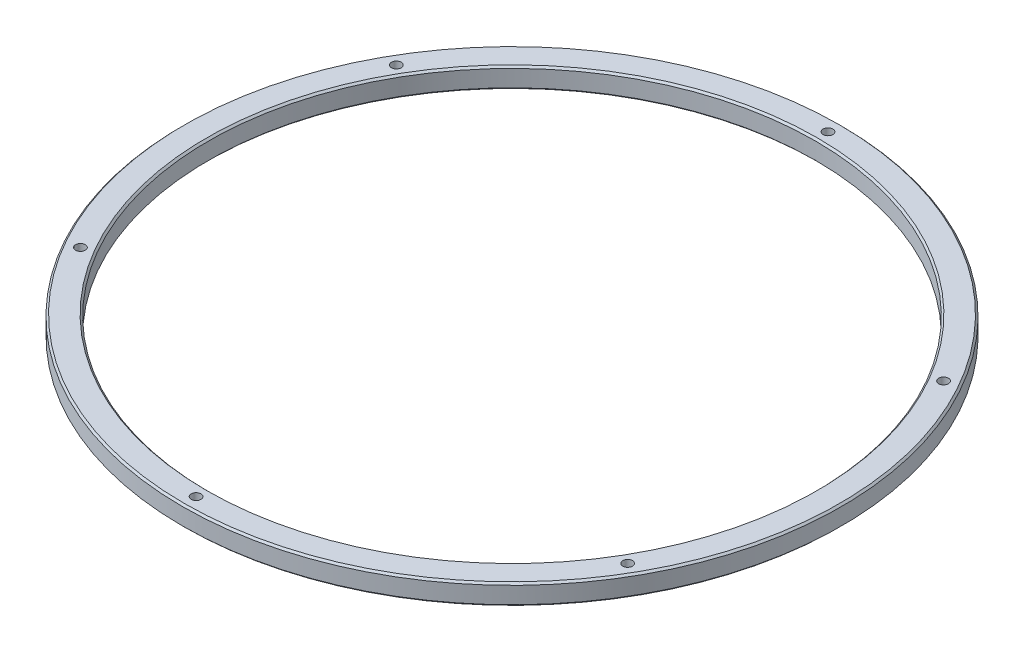
ISO-10303-21;
HEADER;
FILE_DESCRIPTION(('STEP AP214'),'2;1');
FILE_NAME('part.step','',(''),(''),'','','');
FILE_SCHEMA(('AUTOMOTIVE_DESIGN { 1 0 10303 214 1 1 1 1 }'));
ENDSEC;
DATA;
#1=APPLICATION_CONTEXT('core data for automotive mechanical design processes');
#2=APPLICATION_PROTOCOL_DEFINITION('international standard','automotive_design',2000,#1);
#3=PRODUCT_CONTEXT('',#1,'mechanical');
#4=PRODUCT('Part','Part','',(#3));
#5=PRODUCT_RELATED_PRODUCT_CATEGORY('part','',(#4));
#6=PRODUCT_DEFINITION_FORMATION('','',#4);
#7=PRODUCT_DEFINITION_CONTEXT('part definition',#1,'design');
#8=PRODUCT_DEFINITION('design','',#6,#7);
#9=PRODUCT_DEFINITION_SHAPE('','',#8);
#10=(LENGTH_UNIT() NAMED_UNIT(*) SI_UNIT(.MILLI.,.METRE.));
#11=(NAMED_UNIT(*) PLANE_ANGLE_UNIT() SI_UNIT($,.RADIAN.));
#12=(NAMED_UNIT(*) SI_UNIT($,.STERADIAN.) SOLID_ANGLE_UNIT());
#13=UNCERTAINTY_MEASURE_WITH_UNIT(LENGTH_MEASURE(1.E-05),#10,'distance_accuracy_value','');
#14=(GEOMETRIC_REPRESENTATION_CONTEXT(3) GLOBAL_UNCERTAINTY_ASSIGNED_CONTEXT((#13)) GLOBAL_UNIT_ASSIGNED_CONTEXT((#10,
#11,#12)) REPRESENTATION_CONTEXT('',''));
#15=CARTESIAN_POINT('',(0.,0.,0.));
#16=DIRECTION('',(0.,0.,1.));
#17=DIRECTION('',(1.,0.,0.));
#18=AXIS2_PLACEMENT_3D('',#15,#16,#17);
#19=CARTESIAN_POINT('',(0.,10.,0.));
#20=DIRECTION('',(0.,1.,0.));
#21=DIRECTION('',(0.,0.,1.));
#22=AXIS2_PLACEMENT_3D('',#19,#20,#21);
#23=PLANE('',#22);
#24=CARTESIAN_POINT('',(0.,10.,0.));
#25=DIRECTION('',(0.,1.,0.));
#26=DIRECTION('',(0.,0.,1.));
#27=AXIS2_PLACEMENT_3D('',#24,#25,#26);
#28=CIRCLE('',#27,149.346000012);
#29=CARTESIAN_POINT('',(0.,10.,149.346000012));
#30=VERTEX_POINT('',#29);
#31=EDGE_CURVE('E83',#30,#30,#28,.F.);
#32=ORIENTED_EDGE('',*,*,#31,.T.);
#33=EDGE_LOOP('',(#32));
#34=FACE_BOUND('',#33,.T.);
#35=CARTESIAN_POINT('',(0.,10.,0.));
#36=DIRECTION('',(0.,1.,0.));
#37=DIRECTION('',(0.,0.,1.));
#38=AXIS2_PLACEMENT_3D('',#35,#36,#37);
#39=CIRCLE('',#38,160.268000012);
#40=CARTESIAN_POINT('',(0.,10.,160.268000012));
#41=VERTEX_POINT('',#40);
#42=EDGE_CURVE('E87',#41,#41,#39,.T.);
#43=ORIENTED_EDGE('',*,*,#42,.T.);
#44=EDGE_LOOP('',(#43));
#45=FACE_BOUND('',#44,.T.);
#46=CARTESIAN_POINT('',(-133.80092488471,10.,77.2499999999761));
#47=DIRECTION('',(0.,1.,0.));
#48=DIRECTION('',(0.,0.,1.));
#49=AXIS2_PLACEMENT_3D('',#46,#47,#48);
#50=CIRCLE('',#49,2.38125);
#51=CARTESIAN_POINT('',(-133.80092488471,10.,79.6312499999761));
#52=VERTEX_POINT('',#51);
#53=EDGE_CURVE('E128',#52,#52,#50,.T.);
#54=ORIENTED_EDGE('',*,*,#53,.F.);
#55=EDGE_LOOP('',(#54));
#56=FACE_BOUND('',#55,.T.);
#57=CARTESIAN_POINT('',(133.800924884689,10.,77.2500000000119));
#58=DIRECTION('',(0.,1.,0.));
#59=DIRECTION('',(0.,0.,1.));
#60=AXIS2_PLACEMENT_3D('',#57,#58,#59);
#61=CIRCLE('',#60,2.38125);
#62=CARTESIAN_POINT('',(133.800924884689,10.,79.6312500000119));
#63=VERTEX_POINT('',#62);
#64=EDGE_CURVE('E116',#63,#63,#61,.T.);
#65=ORIENTED_EDGE('',*,*,#64,.F.);
#66=EDGE_LOOP('',(#65));
#67=FACE_BOUND('',#66,.T.);
#68=CARTESIAN_POINT('',(0.,10.,-154.5));
#69=DIRECTION('',(0.,1.,0.));
#70=DIRECTION('',(0.,0.,1.));
#71=AXIS2_PLACEMENT_3D('',#68,#69,#70);
#72=CIRCLE('',#71,2.38125);
#73=CARTESIAN_POINT('',(0.,10.,-152.11875));
#74=VERTEX_POINT('',#73);
#75=EDGE_CURVE('E107',#74,#74,#72,.T.);
#76=ORIENTED_EDGE('',*,*,#75,.F.);
#77=EDGE_LOOP('',(#76));
#78=FACE_BOUND('',#77,.T.);
#79=CARTESIAN_POINT('',(133.800924884699,10.,-77.249999999994));
#80=DIRECTION('',(0.,1.,0.));
#81=DIRECTION('',(0.,0.,1.));
#82=AXIS2_PLACEMENT_3D('',#79,#80,#81);
#83=CIRCLE('',#82,2.38125);
#84=CARTESIAN_POINT('',(133.800924884699,10.,-74.868749999994));
#85=VERTEX_POINT('',#84);
#86=EDGE_CURVE('E111',#85,#85,#83,.T.);
#87=ORIENTED_EDGE('',*,*,#86,.F.);
#88=EDGE_LOOP('',(#87));
#89=FACE_BOUND('',#88,.T.);
#90=CARTESIAN_POINT('',(-2.06332258664254E-11,10.,154.5));
#91=DIRECTION('',(0.,1.,0.));
#92=DIRECTION('',(0.,0.,1.));
#93=AXIS2_PLACEMENT_3D('',#90,#91,#92);
#94=CIRCLE('',#93,2.38125);
#95=CARTESIAN_POINT('',(-2.06332258664254E-11,10.,156.88125));
#96=VERTEX_POINT('',#95);
#97=EDGE_CURVE('E123',#96,#96,#94,.T.);
#98=ORIENTED_EDGE('',*,*,#97,.F.);
#99=EDGE_LOOP('',(#98));
#100=FACE_BOUND('',#99,.T.);
#101=CARTESIAN_POINT('',(-133.800924884678,10.,-77.25000000003));
#102=DIRECTION('',(0.,1.,0.));
#103=DIRECTION('',(0.,0.,1.));
#104=AXIS2_PLACEMENT_3D('',#101,#102,#103);
#105=CIRCLE('',#104,2.38125);
#106=CARTESIAN_POINT('',(-133.800924884678,10.,-74.86875000003));
#107=VERTEX_POINT('',#106);
#108=EDGE_CURVE('E135',#107,#107,#105,.T.);
#109=ORIENTED_EDGE('',*,*,#108,.F.);
#110=EDGE_LOOP('',(#109));
#111=FACE_BOUND('',#110,.T.);
#112=ADVANCED_FACE('F42',(#34,#45,#56,#67,#78,#89,#100,#111),#23,.T.);
#113=CARTESIAN_POINT('',(0.,0.,0.));
#114=DIRECTION('',(0.,1.,0.));
#115=DIRECTION('',(0.,0.,1.));
#116=AXIS2_PLACEMENT_3D('',#113,#114,#115);
#117=PLANE('',#116);
#118=CARTESIAN_POINT('',(133.800924884689,0.,77.2500000000119));
#119=DIRECTION('',(0.,1.,0.));
#120=DIRECTION('',(0.,0.,1.));
#121=AXIS2_PLACEMENT_3D('',#118,#119,#120);
#122=CIRCLE('',#121,4.92124999999999);
#123=CARTESIAN_POINT('',(133.800924884689,0.,82.1712500000119));
#124=VERTEX_POINT('',#123);
#125=EDGE_CURVE('E61',#124,#124,#122,.T.);
#126=ORIENTED_EDGE('',*,*,#125,.T.);
#127=EDGE_LOOP('',(#126));
#128=FACE_BOUND('',#127,.T.);
#129=CARTESIAN_POINT('',(-133.80092488471,0.,77.2499999999761));
#130=DIRECTION('',(0.,1.,0.));
#131=DIRECTION('',(0.,0.,1.));
#132=AXIS2_PLACEMENT_3D('',#129,#130,#131);
#133=CIRCLE('',#132,4.51256306319026);
#134=CARTESIAN_POINT('',(-133.80092488471,0.,81.7625630631663));
#135=VERTEX_POINT('',#134);
#136=EDGE_CURVE('E67',#135,#135,#133,.T.);
#137=ORIENTED_EDGE('',*,*,#136,.T.);
#138=EDGE_LOOP('',(#137));
#139=FACE_BOUND('',#138,.T.);
#140=CARTESIAN_POINT('',(0.,0.,-154.5));
#141=DIRECTION('',(0.,1.,0.));
#142=DIRECTION('',(0.,0.,1.));
#143=AXIS2_PLACEMENT_3D('',#140,#141,#142);
#144=CIRCLE('',#143,4.51256306319026);
#145=CARTESIAN_POINT('',(0.,0.,-149.98743693681));
#146=VERTEX_POINT('',#145);
#147=EDGE_CURVE('E71',#146,#146,#144,.T.);
#148=ORIENTED_EDGE('',*,*,#147,.T.);
#149=EDGE_LOOP('',(#148));
#150=FACE_BOUND('',#149,.T.);
#151=CARTESIAN_POINT('',(0.,0.,0.));
#152=DIRECTION('',(0.,1.,0.));
#153=DIRECTION('',(0.,0.,1.));
#154=AXIS2_PLACEMENT_3D('',#151,#152,#153);
#155=CIRCLE('',#154,149.346000012);
#156=CARTESIAN_POINT('',(0.,0.,149.346000012));
#157=VERTEX_POINT('',#156);
#158=EDGE_CURVE('E99',#157,#157,#155,.T.);
#159=ORIENTED_EDGE('',*,*,#158,.T.);
#160=EDGE_LOOP('',(#159));
#161=FACE_BOUND('',#160,.T.);
#162=CARTESIAN_POINT('',(0.,0.,0.));
#163=DIRECTION('',(0.,1.,0.));
#164=DIRECTION('',(0.,0.,1.));
#165=AXIS2_PLACEMENT_3D('',#162,#163,#164);
#166=CIRCLE('',#165,160.268000012);
#167=CARTESIAN_POINT('',(0.,0.,160.268000012));
#168=VERTEX_POINT('',#167);
#169=EDGE_CURVE('E103',#168,#168,#166,.F.);
#170=ORIENTED_EDGE('',*,*,#169,.T.);
#171=EDGE_LOOP('',(#170));
#172=FACE_BOUND('',#171,.T.);
#173=CARTESIAN_POINT('',(133.800924884699,0.,-77.249999999994));
#174=DIRECTION('',(0.,1.,0.));
#175=DIRECTION('',(0.,0.,1.));
#176=AXIS2_PLACEMENT_3D('',#173,#174,#175);
#177=CIRCLE('',#176,2.38125);
#178=CARTESIAN_POINT('',(133.800924884699,0.,-74.868749999994));
#179=VERTEX_POINT('',#178);
#180=EDGE_CURVE('E112',#179,#179,#177,.T.);
#181=ORIENTED_EDGE('',*,*,#180,.T.);
#182=EDGE_LOOP('',(#181));
#183=FACE_BOUND('',#182,.T.);
#184=CARTESIAN_POINT('',(-2.06332258664254E-11,0.,154.5));
#185=DIRECTION('',(0.,1.,0.));
#186=DIRECTION('',(0.,0.,1.));
#187=AXIS2_PLACEMENT_3D('',#184,#185,#186);
#188=CIRCLE('',#187,2.38125);
#189=CARTESIAN_POINT('',(-2.06332258664254E-11,0.,156.88125));
#190=VERTEX_POINT('',#189);
#191=EDGE_CURVE('E124',#190,#190,#188,.T.);
#192=ORIENTED_EDGE('',*,*,#191,.T.);
#193=EDGE_LOOP('',(#192));
#194=FACE_BOUND('',#193,.T.);
#195=CARTESIAN_POINT('',(-133.800924884678,0.,-77.25000000003));
#196=DIRECTION('',(0.,1.,0.));
#197=DIRECTION('',(0.,0.,1.));
#198=AXIS2_PLACEMENT_3D('',#195,#196,#197);
#199=CIRCLE('',#198,2.38125);
#200=CARTESIAN_POINT('',(-133.800924884678,0.,-74.86875000003));
#201=VERTEX_POINT('',#200);
#202=EDGE_CURVE('E136',#201,#201,#199,.T.);
#203=ORIENTED_EDGE('',*,*,#202,.T.);
#204=EDGE_LOOP('',(#203));
#205=FACE_BOUND('',#204,.T.);
#206=ADVANCED_FACE('F148',(#128,#139,#150,#161,#172,#183,#194,#205),#117,.F.);
#207=CARTESIAN_POINT('',(0.,10.,0.));
#208=DIRECTION('',(0.,-1.,0.));
#209=DIRECTION('',(0.,0.,-1.));
#210=AXIS2_PLACEMENT_3D('',#207,#208,#209);
#211=CYLINDRICAL_SURFACE('',#210,161.157000012);
#212=CARTESIAN_POINT('',(0.,0.889000000000112,0.));
#213=DIRECTION('',(0.,1.,0.));
#214=DIRECTION('',(0.,0.,1.));
#215=AXIS2_PLACEMENT_3D('',#212,#213,#214);
#216=CIRCLE('',#215,161.157000012);
#217=CARTESIAN_POINT('',(0.,0.889000000000112,161.157000012));
#218=VERTEX_POINT('',#217);
#219=EDGE_CURVE('E75',#218,#218,#216,.T.);
#220=ORIENTED_EDGE('',*,*,#219,.T.);
#221=EDGE_LOOP('',(#220));
#222=FACE_BOUND('',#221,.T.);
#223=CARTESIAN_POINT('',(0.,9.11100000000008,0.));
#224=DIRECTION('',(0.,1.,0.));
#225=DIRECTION('',(0.,0.,1.));
#226=AXIS2_PLACEMENT_3D('',#223,#224,#225);
#227=CIRCLE('',#226,161.157000012);
#228=CARTESIAN_POINT('',(0.,9.11100000000008,161.157000012));
#229=VERTEX_POINT('',#228);
#230=EDGE_CURVE('E79',#229,#229,#227,.F.);
#231=ORIENTED_EDGE('',*,*,#230,.T.);
#232=EDGE_LOOP('',(#231));
#233=FACE_BOUND('',#232,.T.);
#234=ADVANCED_FACE('F154',(#222,#233),#211,.T.);
#235=CARTESIAN_POINT('',(0.,10.,0.));
#236=DIRECTION('',(0.,-1.,0.));
#237=DIRECTION('',(0.,0.,-1.));
#238=AXIS2_PLACEMENT_3D('',#235,#236,#237);
#239=CYLINDRICAL_SURFACE('',#238,148.457000012);
#240=CARTESIAN_POINT('',(0.,0.888999999999945,0.));
#241=DIRECTION('',(0.,1.,0.));
#242=DIRECTION('',(0.,0.,1.));
#243=AXIS2_PLACEMENT_3D('',#240,#241,#242);
#244=CIRCLE('',#243,148.457000012);
#245=CARTESIAN_POINT('',(0.,0.888999999999945,148.457000012));
#246=VERTEX_POINT('',#245);
#247=EDGE_CURVE('E91',#246,#246,#244,.F.);
#248=ORIENTED_EDGE('',*,*,#247,.T.);
#249=EDGE_LOOP('',(#248));
#250=FACE_BOUND('',#249,.T.);
#251=CARTESIAN_POINT('',(0.,9.11100000000008,0.));
#252=DIRECTION('',(0.,1.,0.));
#253=DIRECTION('',(0.,0.,1.));
#254=AXIS2_PLACEMENT_3D('',#251,#252,#253);
#255=CIRCLE('',#254,148.457000012);
#256=CARTESIAN_POINT('',(0.,9.11100000000008,148.457000012));
#257=VERTEX_POINT('',#256);
#258=EDGE_CURVE('E95',#257,#257,#255,.T.);
#259=ORIENTED_EDGE('',*,*,#258,.T.);
#260=EDGE_LOOP('',(#259));
#261=FACE_BOUND('',#260,.T.);
#262=ADVANCED_FACE('F159',(#250,#261),#239,.F.);
#263=CARTESIAN_POINT('',(0.,10.,-154.5));
#264=DIRECTION('',(0.,-1.,0.));
#265=DIRECTION('',(0.,0.,-1.));
#266=AXIS2_PLACEMENT_3D('',#263,#264,#265);
#267=CYLINDRICAL_SURFACE('',#266,2.38125);
#268=CARTESIAN_POINT('',(0.,2.53999999999994,-154.5));
#269=DIRECTION('',(0.,1.,0.));
#270=DIRECTION('',(0.,0.,1.));
#271=AXIS2_PLACEMENT_3D('',#268,#269,#270);
#272=CIRCLE('',#271,2.38125);
#273=CARTESIAN_POINT('',(0.,2.53999999999994,-152.11875));
#274=VERTEX_POINT('',#273);
#275=EDGE_CURVE('E10',#274,#274,#272,.F.);
#276=ORIENTED_EDGE('',*,*,#275,.T.);
#277=EDGE_LOOP('',(#276));
#278=FACE_BOUND('',#277,.T.);
#279=ORIENTED_EDGE('',*,*,#75,.T.);
#280=EDGE_LOOP('',(#279));
#281=FACE_BOUND('',#280,.T.);
#282=ADVANCED_FACE('F242',(#278,#281),#267,.F.);
#283=CARTESIAN_POINT('',(133.800924884699,10.,-77.249999999994));
#284=DIRECTION('',(0.,-1.,0.));
#285=DIRECTION('',(0.,0.,-1.));
#286=AXIS2_PLACEMENT_3D('',#283,#284,#285);
#287=CYLINDRICAL_SURFACE('',#286,2.38125);
#288=ORIENTED_EDGE('',*,*,#86,.T.);
#289=EDGE_LOOP('',(#288));
#290=FACE_BOUND('',#289,.T.);
#291=ORIENTED_EDGE('',*,*,#180,.F.);
#292=EDGE_LOOP('',(#291));
#293=FACE_BOUND('',#292,.T.);
#294=ADVANCED_FACE('F239',(#290,#293),#287,.F.);
#295=CARTESIAN_POINT('',(133.800924884689,10.,77.2500000000119));
#296=DIRECTION('',(0.,-1.,0.));
#297=DIRECTION('',(0.,0.,-1.));
#298=AXIS2_PLACEMENT_3D('',#295,#296,#297);
#299=CYLINDRICAL_SURFACE('',#298,2.38125);
#300=CARTESIAN_POINT('',(133.800924884689,2.13131306319025,77.2500000000119));
#301=DIRECTION('',(0.,1.,0.));
#302=DIRECTION('',(0.,0.,1.));
#303=AXIS2_PLACEMENT_3D('',#300,#301,#302);
#304=CIRCLE('',#303,2.38125);
#305=CARTESIAN_POINT('',(133.800924884689,2.13131306319025,79.6312500000119));
#306=VERTEX_POINT('',#305);
#307=EDGE_CURVE('E56',#306,#306,#304,.F.);
#308=ORIENTED_EDGE('',*,*,#307,.T.);
#309=EDGE_LOOP('',(#308));
#310=FACE_BOUND('',#309,.T.);
#311=ORIENTED_EDGE('',*,*,#64,.T.);
#312=EDGE_LOOP('',(#311));
#313=FACE_BOUND('',#312,.T.);
#314=ADVANCED_FACE('F235',(#310,#313),#299,.F.);
#315=CARTESIAN_POINT('',(-2.06332258664254E-11,10.,154.5));
#316=DIRECTION('',(0.,-1.,0.));
#317=DIRECTION('',(0.,0.,-1.));
#318=AXIS2_PLACEMENT_3D('',#315,#316,#317);
#319=CYLINDRICAL_SURFACE('',#318,2.38125);
#320=ORIENTED_EDGE('',*,*,#97,.T.);
#321=EDGE_LOOP('',(#320));
#322=FACE_BOUND('',#321,.T.);
#323=ORIENTED_EDGE('',*,*,#191,.F.);
#324=EDGE_LOOP('',(#323));
#325=FACE_BOUND('',#324,.T.);
#326=ADVANCED_FACE('F230',(#322,#325),#319,.F.);
#327=CARTESIAN_POINT('',(-133.80092488471,10.,77.2499999999761));
#328=DIRECTION('',(0.,-1.,0.));
#329=DIRECTION('',(0.,0.,-1.));
#330=AXIS2_PLACEMENT_3D('',#327,#328,#329);
#331=CYLINDRICAL_SURFACE('',#330,2.38125);
#332=CARTESIAN_POINT('',(-133.80092488471,2.54000000000001,77.2499999999761));
#333=DIRECTION('',(0.,1.,0.));
#334=DIRECTION('',(0.,0.,1.));
#335=AXIS2_PLACEMENT_3D('',#332,#333,#334);
#336=CIRCLE('',#335,2.38125);
#337=CARTESIAN_POINT('',(-133.80092488471,2.54000000000001,79.6312499999761));
#338=VERTEX_POINT('',#337);
#339=EDGE_CURVE('E51',#338,#338,#336,.F.);
#340=ORIENTED_EDGE('',*,*,#339,.T.);
#341=EDGE_LOOP('',(#340));
#342=FACE_BOUND('',#341,.T.);
#343=ORIENTED_EDGE('',*,*,#53,.T.);
#344=EDGE_LOOP('',(#343));
#345=FACE_BOUND('',#344,.T.);
#346=ADVANCED_FACE('F225',(#342,#345),#331,.F.);
#347=CARTESIAN_POINT('',(-133.800924884678,10.,-77.25000000003));
#348=DIRECTION('',(0.,-1.,0.));
#349=DIRECTION('',(0.,0.,-1.));
#350=AXIS2_PLACEMENT_3D('',#347,#348,#349);
#351=CYLINDRICAL_SURFACE('',#350,2.38125);
#352=ORIENTED_EDGE('',*,*,#108,.T.);
#353=EDGE_LOOP('',(#352));
#354=FACE_BOUND('',#353,.T.);
#355=ORIENTED_EDGE('',*,*,#202,.F.);
#356=EDGE_LOOP('',(#355));
#357=FACE_BOUND('',#356,.T.);
#358=ADVANCED_FACE('F144',(#354,#357),#351,.F.);
#359=CARTESIAN_POINT('',(0.,0.,0.));
#360=DIRECTION('',(0.,-1.,0.));
#361=DIRECTION('',(0.,0.,-1.));
#362=AXIS2_PLACEMENT_3D('',#359,#360,#361);
#363=CONICAL_SURFACE('',#362,149.346000012,0.785398163397433);
#364=ORIENTED_EDGE('',*,*,#247,.F.);
#365=EDGE_LOOP('',(#364));
#366=FACE_BOUND('',#365,.T.);
#367=ORIENTED_EDGE('',*,*,#158,.F.);
#368=EDGE_LOOP('',(#367));
#369=FACE_BOUND('',#368,.T.);
#370=ADVANCED_FACE('F166',(#366,#369),#363,.F.);
#371=CARTESIAN_POINT('',(0.,9.11100000000008,0.));
#372=DIRECTION('',(0.,1.,0.));
#373=DIRECTION('',(0.,0.,1.));
#374=AXIS2_PLACEMENT_3D('',#371,#372,#373);
#375=CONICAL_SURFACE('',#374,148.457000012,0.78539816339748);
#376=ORIENTED_EDGE('',*,*,#31,.F.);
#377=EDGE_LOOP('',(#376));
#378=FACE_BOUND('',#377,.T.);
#379=ORIENTED_EDGE('',*,*,#258,.F.);
#380=EDGE_LOOP('',(#379));
#381=FACE_BOUND('',#380,.T.);
#382=ADVANCED_FACE('F172',(#378,#381),#375,.F.);
#383=CARTESIAN_POINT('',(0.,0.889000000000112,0.));
#384=DIRECTION('',(0.,1.,0.));
#385=DIRECTION('',(0.,0.,1.));
#386=AXIS2_PLACEMENT_3D('',#383,#384,#385);
#387=CONICAL_SURFACE('',#386,161.157000012,0.785398163397448);
#388=ORIENTED_EDGE('',*,*,#169,.F.);
#389=EDGE_LOOP('',(#388));
#390=FACE_BOUND('',#389,.T.);
#391=ORIENTED_EDGE('',*,*,#219,.F.);
#392=EDGE_LOOP('',(#391));
#393=FACE_BOUND('',#392,.T.);
#394=ADVANCED_FACE('F179',(#390,#393),#387,.T.);
#395=CARTESIAN_POINT('',(0.,10.,0.));
#396=DIRECTION('',(0.,-1.,0.));
#397=DIRECTION('',(0.,0.,-1.));
#398=AXIS2_PLACEMENT_3D('',#395,#396,#397);
#399=CONICAL_SURFACE('',#398,160.268000012,0.785398163397448);
#400=ORIENTED_EDGE('',*,*,#230,.F.);
#401=EDGE_LOOP('',(#400));
#402=FACE_BOUND('',#401,.T.);
#403=ORIENTED_EDGE('',*,*,#42,.F.);
#404=EDGE_LOOP('',(#403));
#405=FACE_BOUND('',#404,.T.);
#406=ADVANCED_FACE('F186',(#402,#405),#399,.T.);
#407=CARTESIAN_POINT('',(133.800924884689,0.,77.2500000000119));
#408=DIRECTION('',(0.,-1.,0.));
#409=DIRECTION('',(0.,0.,-1.));
#410=AXIS2_PLACEMENT_3D('',#407,#408,#409);
#411=CONICAL_SURFACE('',#410,4.92124999999999,0.872664625997172);
#412=ORIENTED_EDGE('',*,*,#307,.F.);
#413=EDGE_LOOP('',(#412));
#414=FACE_BOUND('',#413,.T.);
#415=ORIENTED_EDGE('',*,*,#125,.F.);
#416=EDGE_LOOP('',(#415));
#417=FACE_BOUND('',#416,.T.);
#418=ADVANCED_FACE('F193',(#414,#417),#411,.F.);
#419=CARTESIAN_POINT('',(-133.80092488471,0.,77.2499999999761));
#420=DIRECTION('',(0.,-1.,0.));
#421=DIRECTION('',(0.,0.,-1.));
#422=AXIS2_PLACEMENT_3D('',#419,#420,#421);
#423=CONICAL_SURFACE('',#422,4.51256306319026,0.698131700797721);
#424=ORIENTED_EDGE('',*,*,#339,.F.);
#425=EDGE_LOOP('',(#424));
#426=FACE_BOUND('',#425,.T.);
#427=ORIENTED_EDGE('',*,*,#136,.F.);
#428=EDGE_LOOP('',(#427));
#429=FACE_BOUND('',#428,.T.);
#430=ADVANCED_FACE('F199',(#426,#429),#423,.F.);
#431=CARTESIAN_POINT('',(0.,0.,-154.5));
#432=DIRECTION('',(0.,-1.,0.));
#433=DIRECTION('',(0.,0.,-1.));
#434=AXIS2_PLACEMENT_3D('',#431,#432,#433);
#435=CONICAL_SURFACE('',#434,4.51256306319026,0.698131700797736);
#436=ORIENTED_EDGE('',*,*,#275,.F.);
#437=EDGE_LOOP('',(#436));
#438=FACE_BOUND('',#437,.T.);
#439=ORIENTED_EDGE('',*,*,#147,.F.);
#440=EDGE_LOOP('',(#439));
#441=FACE_BOUND('',#440,.T.);
#442=ADVANCED_FACE('F45',(#438,#441),#435,.F.);
#443=CLOSED_SHELL('',(#112,#206,#234,#262,#282,#294,#314,#326,#346,#358,#370,#382,#394,#406,
#418,#430,#442));
#444=MANIFOLD_SOLID_BREP('B2',#443);
#445=ADVANCED_BREP_SHAPE_REPRESENTATION('',(#18,#444),#14);
#446=SHAPE_DEFINITION_REPRESENTATION(#9,#445);
ENDSEC;
END-ISO-10303-21;
